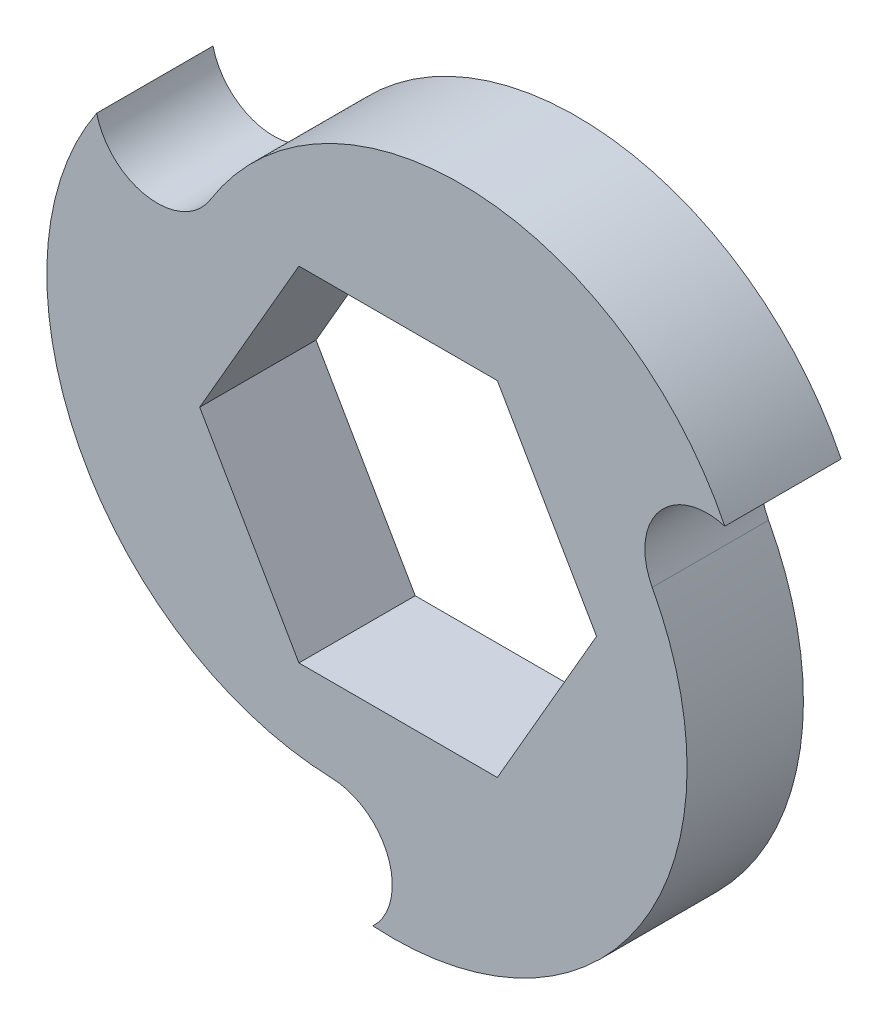
ISO-10303-21;
HEADER;
FILE_DESCRIPTION(('STEP AP214'),'2;1');
FILE_NAME('part.step','',(''),(''),'','','');
FILE_SCHEMA(('AUTOMOTIVE_DESIGN { 1 0 10303 214 1 1 1 1 }'));
ENDSEC;
DATA;
#1=APPLICATION_CONTEXT('core data for automotive mechanical design processes');
#2=APPLICATION_PROTOCOL_DEFINITION('international standard','automotive_design',2000,#1);
#3=PRODUCT_CONTEXT('',#1,'mechanical');
#4=PRODUCT('Part','Part','',(#3));
#5=PRODUCT_RELATED_PRODUCT_CATEGORY('part','',(#4));
#6=PRODUCT_DEFINITION_FORMATION('','',#4);
#7=PRODUCT_DEFINITION_CONTEXT('part definition',#1,'design');
#8=PRODUCT_DEFINITION('design','',#6,#7);
#9=PRODUCT_DEFINITION_SHAPE('','',#8);
#10=(LENGTH_UNIT() NAMED_UNIT(*) SI_UNIT(.MILLI.,.METRE.));
#11=(NAMED_UNIT(*) PLANE_ANGLE_UNIT() SI_UNIT($,.RADIAN.));
#12=(NAMED_UNIT(*) SI_UNIT($,.STERADIAN.) SOLID_ANGLE_UNIT());
#13=UNCERTAINTY_MEASURE_WITH_UNIT(LENGTH_MEASURE(1.E-05),#10,'distance_accuracy_value','');
#14=(GEOMETRIC_REPRESENTATION_CONTEXT(3) GLOBAL_UNCERTAINTY_ASSIGNED_CONTEXT((#13)) GLOBAL_UNIT_ASSIGNED_CONTEXT((#10,
#11,#12)) REPRESENTATION_CONTEXT('',''));
#15=CARTESIAN_POINT('',(0.,0.,0.));
#16=DIRECTION('',(0.,0.,1.));
#17=DIRECTION('',(1.,0.,0.));
#18=AXIS2_PLACEMENT_3D('',#15,#16,#17);
#19=CARTESIAN_POINT('',(-1.39494313142005,-7.3057337522295,4.4));
#20=DIRECTION('',(0.,0.,-1.));
#21=DIRECTION('',(-1.,0.,0.));
#22=AXIS2_PLACEMENT_3D('',#19,#20,#21);
#23=PLANE('',#22);
#24=CARTESIAN_POINT('',(-0.209275396929008,-2.60204479361401,4.4));
#25=DIRECTION('',(0.,0.,1.));
#26=DIRECTION('',(-1.,0.,0.));
#27=AXIS2_PLACEMENT_3D('',#24,#25,#26);
#28=CIRCLE('',#27,11.1397436958321);
#29=CARTESIAN_POINT('',(-0.953157803575311,-13.7169234962321,4.4));
#30=VERTEX_POINT('',#29);
#31=CARTESIAN_POINT('',(9.61126501862957,2.65636518994684,4.4));
#32=VERTEX_POINT('',#31);
#33=EDGE_CURVE('E200',#30,#32,#28,.T.);
#34=ORIENTED_EDGE('',*,*,#33,.T.);
#35=CARTESIAN_POINT('',(11.6907705853331,3.76983678826125,4.4));
#36=DIRECTION('',(0.,0.,-1.));
#37=DIRECTION('',(1.,0.,0.));
#38=AXIS2_PLACEMENT_3D('',#35,#36,#37);
#39=CIRCLE('',#38,2.35884768524883);
#40=CARTESIAN_POINT('',(12.3557831112923,6.03300287640438,4.4));
#41=VERTEX_POINT('',#40);
#42=EDGE_CURVE('E204',#32,#41,#39,.T.);
#43=ORIENTED_EDGE('',*,*,#42,.T.);
#44=CARTESIAN_POINT('',(2.3580745915193,1.11978458667937,4.4));
#45=DIRECTION('',(0.,0.,1.));
#46=DIRECTION('',(-1.,0.,0.));
#47=AXIS2_PLACEMENT_3D('',#44,#45,#46);
#48=CIRCLE('',#47,11.1397436958321);
#49=CARTESIAN_POINT('',(-7.10611224553738,6.99541707366444,4.4));
#50=VERTEX_POINT('',#49);
#51=EDGE_CURVE('E208',#41,#50,#48,.T.);
#52=ORIENTED_EDGE('',*,*,#51,.T.);
#53=CARTESIAN_POINT('',(-9.11015971942193,8.23958592258361,4.4));
#54=DIRECTION('',(0.,0.,-1.));
#55=DIRECTION('',(1.,0.,0.));
#56=AXIS2_PLACEMENT_3D('',#53,#54,#55);
#57=CIRCLE('',#56,2.35884768524882);
#58=CARTESIAN_POINT('',(-11.402625307717,7.68392061982767,4.4));
#59=VERTEX_POINT('',#58);
#60=EDGE_CURVE('E211',#50,#59,#57,.T.);
#61=ORIENTED_EDGE('',*,*,#60,.T.);
#62=CARTESIAN_POINT('',(-2.14879919459025,1.48226020693456,4.4));
#63=DIRECTION('',(0.,0.,1.));
#64=DIRECTION('',(-1.,0.,0.));
#65=AXIS2_PLACEMENT_3D('',#62,#63,#64);
#66=CIRCLE('',#65,11.1397436958321);
#67=CARTESIAN_POINT('',(-2.50515277309212,-9.65178226361135,4.4));
#68=VERTEX_POINT('',#67);
#69=EDGE_CURVE('E214',#59,#68,#66,.T.);
#70=ORIENTED_EDGE('',*,*,#69,.T.);
#71=CARTESIAN_POINT('',(-2.58061086591109,-12.009422710845,4.4));
#72=DIRECTION('',(0.,0.,-1.));
#73=DIRECTION('',(1.,0.,0.));
#74=AXIS2_PLACEMENT_3D('',#71,#72,#73);
#75=CIRCLE('',#74,2.35884768524883);
#76=EDGE_CURVE('E217',#68,#30,#75,.T.);
#77=ORIENTED_EDGE('',*,*,#76,.T.);
#78=EDGE_LOOP('',(#34,#43,#52,#61,#70,#77));
#79=FACE_BOUND('',#78,.T.);
#80=DIRECTION('',(0.5,0.866025403784438,0.));
#81=VECTOR('',#80,1.);
#82=CARTESIAN_POINT('',(3.75277674973256,-6.5,4.4));
#83=LINE('',#82,#81);
#84=CARTESIAN_POINT('',(3.75277674973256,-6.5,4.4));
#85=VERTEX_POINT('',#84);
#86=CARTESIAN_POINT('',(7.50555349946513,0.,4.4));
#87=VERTEX_POINT('',#86);
#88=EDGE_CURVE('E131',#85,#87,#83,.T.);
#89=ORIENTED_EDGE('',*,*,#88,.F.);
#90=DIRECTION('',(1.,0.,0.));
#91=VECTOR('',#90,1.);
#92=CARTESIAN_POINT('',(-3.75277674973257,-6.5,4.4));
#93=LINE('',#92,#91);
#94=CARTESIAN_POINT('',(-3.75277674973257,-6.5,4.4));
#95=VERTEX_POINT('',#94);
#96=EDGE_CURVE('E166',#95,#85,#93,.T.);
#97=ORIENTED_EDGE('',*,*,#96,.F.);
#98=DIRECTION('',(0.5,-0.866025403784439,0.));
#99=VECTOR('',#98,1.);
#100=CARTESIAN_POINT('',(-7.50555349946513,0.,4.4));
#101=LINE('',#100,#99);
#102=CARTESIAN_POINT('',(-7.50555349946513,0.,4.4));
#103=VERTEX_POINT('',#102);
#104=EDGE_CURVE('E163',#103,#95,#101,.T.);
#105=ORIENTED_EDGE('',*,*,#104,.F.);
#106=DIRECTION('',(-0.500000000000001,-0.866025403784438,0.));
#107=VECTOR('',#106,1.);
#108=CARTESIAN_POINT('',(-3.75277674973256,6.5,4.4));
#109=LINE('',#108,#107);
#110=CARTESIAN_POINT('',(-3.75277674973256,6.5,4.4));
#111=VERTEX_POINT('',#110);
#112=EDGE_CURVE('E158',#111,#103,#109,.T.);
#113=ORIENTED_EDGE('',*,*,#112,.F.);
#114=DIRECTION('',(-1.,0.,0.));
#115=VECTOR('',#114,1.);
#116=CARTESIAN_POINT('',(3.75277674973257,6.5,4.4));
#117=LINE('',#116,#115);
#118=CARTESIAN_POINT('',(3.75277674973257,6.5,4.4));
#119=VERTEX_POINT('',#118);
#120=EDGE_CURVE('E154',#119,#111,#117,.T.);
#121=ORIENTED_EDGE('',*,*,#120,.F.);
#122=DIRECTION('',(-0.5,0.866025403784439,0.));
#123=VECTOR('',#122,1.);
#124=CARTESIAN_POINT('',(7.50555349946513,0.,4.4));
#125=LINE('',#124,#123);
#126=EDGE_CURVE('E140',#87,#119,#125,.T.);
#127=ORIENTED_EDGE('',*,*,#126,.F.);
#128=EDGE_LOOP('',(#89,#97,#105,#113,#121,#127));
#129=FACE_BOUND('',#128,.T.);
#130=ADVANCED_FACE('F41',(#79,#129),#23,.F.);
#131=CARTESIAN_POINT('',(-1.39494313142005,-7.3057337522295,0.));
#132=DIRECTION('',(0.,0.,-1.));
#133=DIRECTION('',(-1.,0.,0.));
#134=AXIS2_PLACEMENT_3D('',#131,#132,#133);
#135=PLANE('',#134);
#136=CARTESIAN_POINT('',(-0.209275396929008,-2.60204479361401,0.));
#137=DIRECTION('',(0.,0.,1.));
#138=DIRECTION('',(-1.,0.,0.));
#139=AXIS2_PLACEMENT_3D('',#136,#137,#138);
#140=CIRCLE('',#139,11.1397436958321);
#141=CARTESIAN_POINT('',(-0.953157803575311,-13.7169234962321,0.));
#142=VERTEX_POINT('',#141);
#143=CARTESIAN_POINT('',(9.61126501862957,2.65636518994684,0.));
#144=VERTEX_POINT('',#143);
#145=EDGE_CURVE('E149',#142,#144,#140,.T.);
#146=ORIENTED_EDGE('',*,*,#145,.F.);
#147=CARTESIAN_POINT('',(-2.58061086591109,-12.009422710845,0.));
#148=DIRECTION('',(0.,0.,-1.));
#149=DIRECTION('',(1.,0.,0.));
#150=AXIS2_PLACEMENT_3D('',#147,#148,#149);
#151=CIRCLE('',#150,2.35884768524883);
#152=CARTESIAN_POINT('',(-2.50515277309212,-9.65178226361135,0.));
#153=VERTEX_POINT('',#152);
#154=EDGE_CURVE('E205',#153,#142,#151,.T.);
#155=ORIENTED_EDGE('',*,*,#154,.F.);
#156=CARTESIAN_POINT('',(-2.14879919459025,1.48226020693456,0.));
#157=DIRECTION('',(0.,0.,1.));
#158=DIRECTION('',(-1.,0.,0.));
#159=AXIS2_PLACEMENT_3D('',#156,#157,#158);
#160=CIRCLE('',#159,11.1397436958321);
#161=CARTESIAN_POINT('',(-11.402625307717,7.68392061982767,0.));
#162=VERTEX_POINT('',#161);
#163=EDGE_CURVE('E233',#162,#153,#160,.T.);
#164=ORIENTED_EDGE('',*,*,#163,.F.);
#165=CARTESIAN_POINT('',(-9.11015971942193,8.23958592258361,0.));
#166=DIRECTION('',(0.,0.,-1.));
#167=DIRECTION('',(1.,0.,0.));
#168=AXIS2_PLACEMENT_3D('',#165,#166,#167);
#169=CIRCLE('',#168,2.35884768524882);
#170=CARTESIAN_POINT('',(-7.10611224553738,6.99541707366444,0.));
#171=VERTEX_POINT('',#170);
#172=EDGE_CURVE('E230',#171,#162,#169,.T.);
#173=ORIENTED_EDGE('',*,*,#172,.F.);
#174=CARTESIAN_POINT('',(2.3580745915193,1.11978458667937,0.));
#175=DIRECTION('',(0.,0.,1.));
#176=DIRECTION('',(-1.,0.,0.));
#177=AXIS2_PLACEMENT_3D('',#174,#175,#176);
#178=CIRCLE('',#177,11.1397436958321);
#179=CARTESIAN_POINT('',(12.3557831112923,6.03300287640438,0.));
#180=VERTEX_POINT('',#179);
#181=EDGE_CURVE('E227',#180,#171,#178,.T.);
#182=ORIENTED_EDGE('',*,*,#181,.F.);
#183=CARTESIAN_POINT('',(11.6907705853331,3.76983678826125,0.));
#184=DIRECTION('',(0.,0.,-1.));
#185=DIRECTION('',(1.,0.,0.));
#186=AXIS2_PLACEMENT_3D('',#183,#184,#185);
#187=CIRCLE('',#186,2.35884768524883);
#188=EDGE_CURVE('E224',#144,#180,#187,.T.);
#189=ORIENTED_EDGE('',*,*,#188,.F.);
#190=EDGE_LOOP('',(#146,#155,#164,#173,#182,#189));
#191=FACE_BOUND('',#190,.T.);
#192=DIRECTION('',(1.,0.,0.));
#193=VECTOR('',#192,1.);
#194=CARTESIAN_POINT('',(-3.75277674973257,-6.5,0.));
#195=LINE('',#194,#193);
#196=CARTESIAN_POINT('',(-3.75277674973257,-6.5,0.));
#197=VERTEX_POINT('',#196);
#198=CARTESIAN_POINT('',(3.75277674973256,-6.5,0.));
#199=VERTEX_POINT('',#198);
#200=EDGE_CURVE('E141',#197,#199,#195,.T.);
#201=ORIENTED_EDGE('',*,*,#200,.T.);
#202=DIRECTION('',(0.5,0.866025403784438,0.));
#203=VECTOR('',#202,1.);
#204=CARTESIAN_POINT('',(3.75277674973256,-6.5,0.));
#205=LINE('',#204,#203);
#206=CARTESIAN_POINT('',(7.50555349946513,0.,0.));
#207=VERTEX_POINT('',#206);
#208=EDGE_CURVE('E65',#199,#207,#205,.T.);
#209=ORIENTED_EDGE('',*,*,#208,.T.);
#210=DIRECTION('',(-0.5,0.866025403784439,0.));
#211=VECTOR('',#210,1.);
#212=CARTESIAN_POINT('',(7.50555349946513,0.,0.));
#213=LINE('',#212,#211);
#214=CARTESIAN_POINT('',(3.75277674973257,6.5,0.));
#215=VERTEX_POINT('',#214);
#216=EDGE_CURVE('E147',#207,#215,#213,.T.);
#217=ORIENTED_EDGE('',*,*,#216,.T.);
#218=DIRECTION('',(-1.,0.,0.));
#219=VECTOR('',#218,1.);
#220=CARTESIAN_POINT('',(3.75277674973257,6.5,0.));
#221=LINE('',#220,#219);
#222=CARTESIAN_POINT('',(-3.75277674973256,6.5,0.));
#223=VERTEX_POINT('',#222);
#224=EDGE_CURVE('E173',#215,#223,#221,.T.);
#225=ORIENTED_EDGE('',*,*,#224,.T.);
#226=DIRECTION('',(-0.500000000000001,-0.866025403784438,0.));
#227=VECTOR('',#226,1.);
#228=CARTESIAN_POINT('',(-3.75277674973256,6.5,0.));
#229=LINE('',#228,#227);
#230=CARTESIAN_POINT('',(-7.50555349946513,0.,0.));
#231=VERTEX_POINT('',#230);
#232=EDGE_CURVE('E177',#223,#231,#229,.T.);
#233=ORIENTED_EDGE('',*,*,#232,.T.);
#234=DIRECTION('',(0.5,-0.866025403784439,0.));
#235=VECTOR('',#234,1.);
#236=CARTESIAN_POINT('',(-7.50555349946513,0.,0.));
#237=LINE('',#236,#235);
#238=EDGE_CURVE('E181',#231,#197,#237,.T.);
#239=ORIENTED_EDGE('',*,*,#238,.T.);
#240=EDGE_LOOP('',(#201,#209,#217,#225,#233,#239));
#241=FACE_BOUND('',#240,.T.);
#242=ADVANCED_FACE('F264',(#191,#241),#135,.T.);
#243=CARTESIAN_POINT('',(-0.209275396929008,-2.60204479361401,4.4));
#244=DIRECTION('',(0.,0.,-1.));
#245=DIRECTION('',(-1.,0.,0.));
#246=AXIS2_PLACEMENT_3D('',#243,#244,#245);
#247=CYLINDRICAL_SURFACE('',#246,11.1397436958321);
#248=ORIENTED_EDGE('',*,*,#145,.T.);
#249=DIRECTION('',(0.,0.,-1.));
#250=VECTOR('',#249,1.);
#251=CARTESIAN_POINT('',(9.61126501862957,2.65636518994684,4.4));
#252=LINE('',#251,#250);
#253=EDGE_CURVE('E11',#32,#144,#252,.T.);
#254=ORIENTED_EDGE('',*,*,#253,.F.);
#255=ORIENTED_EDGE('',*,*,#33,.F.);
#256=DIRECTION('',(0.,0.,-1.));
#257=VECTOR('',#256,1.);
#258=CARTESIAN_POINT('',(-0.953157803575311,-13.7169234962321,4.4));
#259=LINE('',#258,#257);
#260=EDGE_CURVE('E220',#30,#142,#259,.T.);
#261=ORIENTED_EDGE('',*,*,#260,.T.);
#262=EDGE_LOOP('',(#248,#254,#255,#261));
#263=FACE_BOUND('',#262,.T.);
#264=ADVANCED_FACE('F43',(#263),#247,.T.);
#265=CARTESIAN_POINT('',(11.6907705853331,3.76983678826125,4.4));
#266=DIRECTION('',(0.,0.,-1.));
#267=DIRECTION('',(-1.,0.,0.));
#268=AXIS2_PLACEMENT_3D('',#265,#266,#267);
#269=CYLINDRICAL_SURFACE('',#268,2.35884768524883);
#270=ORIENTED_EDGE('',*,*,#188,.T.);
#271=DIRECTION('',(0.,0.,-1.));
#272=VECTOR('',#271,1.);
#273=CARTESIAN_POINT('',(12.3557831112923,6.03300287640438,4.4));
#274=LINE('',#273,#272);
#275=EDGE_CURVE('E50',#41,#180,#274,.T.);
#276=ORIENTED_EDGE('',*,*,#275,.F.);
#277=ORIENTED_EDGE('',*,*,#42,.F.);
#278=ORIENTED_EDGE('',*,*,#253,.T.);
#279=EDGE_LOOP('',(#270,#276,#277,#278));
#280=FACE_BOUND('',#279,.T.);
#281=ADVANCED_FACE('F281',(#280),#269,.F.);
#282=CARTESIAN_POINT('',(2.3580745915193,1.11978458667937,4.4));
#283=DIRECTION('',(0.,0.,-1.));
#284=DIRECTION('',(-1.,0.,0.));
#285=AXIS2_PLACEMENT_3D('',#282,#283,#284);
#286=CYLINDRICAL_SURFACE('',#285,11.1397436958321);
#287=ORIENTED_EDGE('',*,*,#181,.T.);
#288=DIRECTION('',(0.,0.,-1.));
#289=VECTOR('',#288,1.);
#290=CARTESIAN_POINT('',(-7.10611224553738,6.99541707366444,4.4));
#291=LINE('',#290,#289);
#292=EDGE_CURVE('E249',#50,#171,#291,.T.);
#293=ORIENTED_EDGE('',*,*,#292,.F.);
#294=ORIENTED_EDGE('',*,*,#51,.F.);
#295=ORIENTED_EDGE('',*,*,#275,.T.);
#296=EDGE_LOOP('',(#287,#293,#294,#295));
#297=FACE_BOUND('',#296,.T.);
#298=ADVANCED_FACE('F258',(#297),#286,.T.);
#299=CARTESIAN_POINT('',(-9.11015971942193,8.23958592258361,4.4));
#300=DIRECTION('',(0.,0.,-1.));
#301=DIRECTION('',(-1.,0.,0.));
#302=AXIS2_PLACEMENT_3D('',#299,#300,#301);
#303=CYLINDRICAL_SURFACE('',#302,2.35884768524882);
#304=ORIENTED_EDGE('',*,*,#172,.T.);
#305=DIRECTION('',(0.,0.,-1.));
#306=VECTOR('',#305,1.);
#307=CARTESIAN_POINT('',(-11.402625307717,7.68392061982767,4.4));
#308=LINE('',#307,#306);
#309=EDGE_CURVE('E245',#59,#162,#308,.T.);
#310=ORIENTED_EDGE('',*,*,#309,.F.);
#311=ORIENTED_EDGE('',*,*,#60,.F.);
#312=ORIENTED_EDGE('',*,*,#292,.T.);
#313=EDGE_LOOP('',(#304,#310,#311,#312));
#314=FACE_BOUND('',#313,.T.);
#315=ADVANCED_FACE('F270',(#314),#303,.F.);
#316=CARTESIAN_POINT('',(-2.14879919459025,1.48226020693456,4.4));
#317=DIRECTION('',(0.,0.,-1.));
#318=DIRECTION('',(-1.,0.,0.));
#319=AXIS2_PLACEMENT_3D('',#316,#317,#318);
#320=CYLINDRICAL_SURFACE('',#319,11.1397436958321);
#321=ORIENTED_EDGE('',*,*,#163,.T.);
#322=DIRECTION('',(0.,0.,-1.));
#323=VECTOR('',#322,1.);
#324=CARTESIAN_POINT('',(-2.50515277309212,-9.65178226361135,4.4));
#325=LINE('',#324,#323);
#326=EDGE_CURVE('E241',#68,#153,#325,.T.);
#327=ORIENTED_EDGE('',*,*,#326,.F.);
#328=ORIENTED_EDGE('',*,*,#69,.F.);
#329=ORIENTED_EDGE('',*,*,#309,.T.);
#330=EDGE_LOOP('',(#321,#327,#328,#329));
#331=FACE_BOUND('',#330,.T.);
#332=ADVANCED_FACE('F274',(#331),#320,.T.);
#333=CARTESIAN_POINT('',(-2.58061086591109,-12.009422710845,4.4));
#334=DIRECTION('',(0.,0.,-1.));
#335=DIRECTION('',(-1.,0.,0.));
#336=AXIS2_PLACEMENT_3D('',#333,#334,#335);
#337=CYLINDRICAL_SURFACE('',#336,2.35884768524883);
#338=ORIENTED_EDGE('',*,*,#154,.T.);
#339=ORIENTED_EDGE('',*,*,#260,.F.);
#340=ORIENTED_EDGE('',*,*,#76,.F.);
#341=ORIENTED_EDGE('',*,*,#326,.T.);
#342=EDGE_LOOP('',(#338,#339,#340,#341));
#343=FACE_BOUND('',#342,.T.);
#344=ADVANCED_FACE('F284',(#343),#337,.F.);
#345=CARTESIAN_POINT('',(3.75277674973256,-6.5,4.4));
#346=DIRECTION('',(-0.866025403784438,0.5,0.));
#347=DIRECTION('',(-0.5,-0.866025403784438,0.));
#348=AXIS2_PLACEMENT_3D('',#345,#346,#347);
#349=PLANE('',#348);
#350=ORIENTED_EDGE('',*,*,#208,.F.);
#351=DIRECTION('',(0.,0.,-1.));
#352=VECTOR('',#351,1.);
#353=CARTESIAN_POINT('',(3.75277674973256,-6.5,4.4));
#354=LINE('',#353,#352);
#355=EDGE_CURVE('E135',#85,#199,#354,.T.);
#356=ORIENTED_EDGE('',*,*,#355,.F.);
#357=ORIENTED_EDGE('',*,*,#88,.T.);
#358=DIRECTION('',(0.,0.,-1.));
#359=VECTOR('',#358,1.);
#360=CARTESIAN_POINT('',(7.50555349946513,0.,4.4));
#361=LINE('',#360,#359);
#362=EDGE_CURVE('E134',#87,#207,#361,.T.);
#363=ORIENTED_EDGE('',*,*,#362,.T.);
#364=EDGE_LOOP('',(#350,#356,#357,#363));
#365=FACE_BOUND('',#364,.T.);
#366=ADVANCED_FACE('F133',(#365),#349,.T.);
#367=CARTESIAN_POINT('',(7.50555349946513,0.,4.4));
#368=DIRECTION('',(-0.866025403784439,-0.5,0.));
#369=DIRECTION('',(0.5,-0.866025403784439,0.));
#370=AXIS2_PLACEMENT_3D('',#367,#368,#369);
#371=PLANE('',#370);
#372=ORIENTED_EDGE('',*,*,#216,.F.);
#373=ORIENTED_EDGE('',*,*,#362,.F.);
#374=ORIENTED_EDGE('',*,*,#126,.T.);
#375=DIRECTION('',(0.,0.,-1.));
#376=VECTOR('',#375,1.);
#377=CARTESIAN_POINT('',(3.75277674973257,6.5,4.4));
#378=LINE('',#377,#376);
#379=EDGE_CURVE('E150',#119,#215,#378,.T.);
#380=ORIENTED_EDGE('',*,*,#379,.T.);
#381=EDGE_LOOP('',(#372,#373,#374,#380));
#382=FACE_BOUND('',#381,.T.);
#383=ADVANCED_FACE('F144',(#382),#371,.T.);
#384=CARTESIAN_POINT('',(3.75277674973257,6.5,4.4));
#385=DIRECTION('',(0.,-1.,0.));
#386=DIRECTION('',(1.,0.,0.));
#387=AXIS2_PLACEMENT_3D('',#384,#385,#386);
#388=PLANE('',#387);
#389=ORIENTED_EDGE('',*,*,#224,.F.);
#390=ORIENTED_EDGE('',*,*,#379,.F.);
#391=ORIENTED_EDGE('',*,*,#120,.T.);
#392=DIRECTION('',(0.,0.,-1.));
#393=VECTOR('',#392,1.);
#394=CARTESIAN_POINT('',(-3.75277674973256,6.5,4.4));
#395=LINE('',#394,#393);
#396=EDGE_CURVE('E195',#111,#223,#395,.T.);
#397=ORIENTED_EDGE('',*,*,#396,.T.);
#398=EDGE_LOOP('',(#389,#390,#391,#397));
#399=FACE_BOUND('',#398,.T.);
#400=ADVANCED_FACE('F302',(#399),#388,.T.);
#401=CARTESIAN_POINT('',(-3.75277674973256,6.5,4.4));
#402=DIRECTION('',(0.866025403784438,-0.500000000000001,0.));
#403=DIRECTION('',(0.500000000000001,0.866025403784438,0.));
#404=AXIS2_PLACEMENT_3D('',#401,#402,#403);
#405=PLANE('',#404);
#406=ORIENTED_EDGE('',*,*,#232,.F.);
#407=ORIENTED_EDGE('',*,*,#396,.F.);
#408=ORIENTED_EDGE('',*,*,#112,.T.);
#409=DIRECTION('',(0.,0.,-1.));
#410=VECTOR('',#409,1.);
#411=CARTESIAN_POINT('',(-7.50555349946513,0.,4.4));
#412=LINE('',#411,#410);
#413=EDGE_CURVE('E192',#103,#231,#412,.T.);
#414=ORIENTED_EDGE('',*,*,#413,.T.);
#415=EDGE_LOOP('',(#406,#407,#408,#414));
#416=FACE_BOUND('',#415,.T.);
#417=ADVANCED_FACE('F305',(#416),#405,.T.);
#418=CARTESIAN_POINT('',(-7.50555349946513,0.,4.4));
#419=DIRECTION('',(0.866025403784439,0.5,0.));
#420=DIRECTION('',(-0.5,0.866025403784439,0.));
#421=AXIS2_PLACEMENT_3D('',#418,#419,#420);
#422=PLANE('',#421);
#423=ORIENTED_EDGE('',*,*,#238,.F.);
#424=ORIENTED_EDGE('',*,*,#413,.F.);
#425=ORIENTED_EDGE('',*,*,#104,.T.);
#426=DIRECTION('',(0.,0.,-1.));
#427=VECTOR('',#426,1.);
#428=CARTESIAN_POINT('',(-3.75277674973257,-6.5,4.4));
#429=LINE('',#428,#427);
#430=EDGE_CURVE('E57',#95,#197,#429,.T.);
#431=ORIENTED_EDGE('',*,*,#430,.T.);
#432=EDGE_LOOP('',(#423,#424,#425,#431));
#433=FACE_BOUND('',#432,.T.);
#434=ADVANCED_FACE('F309',(#433),#422,.T.);
#435=CARTESIAN_POINT('',(-3.75277674973257,-6.5,4.4));
#436=DIRECTION('',(0.,1.,0.));
#437=DIRECTION('',(-1.,0.,0.));
#438=AXIS2_PLACEMENT_3D('',#435,#436,#437);
#439=PLANE('',#438);
#440=ORIENTED_EDGE('',*,*,#200,.F.);
#441=ORIENTED_EDGE('',*,*,#430,.F.);
#442=ORIENTED_EDGE('',*,*,#96,.T.);
#443=ORIENTED_EDGE('',*,*,#355,.T.);
#444=EDGE_LOOP('',(#440,#441,#442,#443));
#445=FACE_BOUND('',#444,.T.);
#446=ADVANCED_FACE('F313',(#445),#439,.T.);
#447=CLOSED_SHELL('',(#130,#242,#264,#281,#298,#315,#332,#344,#366,#383,#400,#417,#434,#446));
#448=MANIFOLD_SOLID_BREP('B2',#447);
#449=ADVANCED_BREP_SHAPE_REPRESENTATION('',(#18,#448),#14);
#450=SHAPE_DEFINITION_REPRESENTATION(#9,#449);
ENDSEC;
END-ISO-10303-21;
